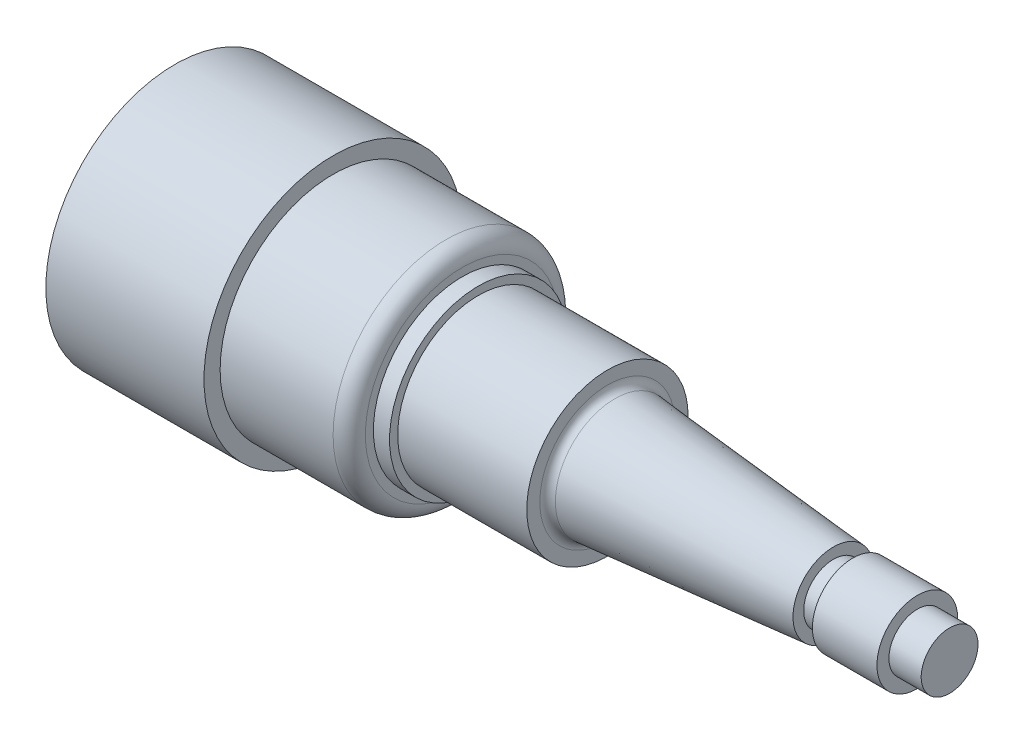
ISO-10303-21;
HEADER;
FILE_DESCRIPTION(('STEP AP214'),'2;1');
FILE_NAME('part.step','',(''),(''),'','','');
FILE_SCHEMA(('AUTOMOTIVE_DESIGN { 1 0 10303 214 1 1 1 1 }'));
ENDSEC;
DATA;
#1=APPLICATION_CONTEXT('core data for automotive mechanical design processes');
#2=APPLICATION_PROTOCOL_DEFINITION('international standard','automotive_design',2000,#1);
#3=PRODUCT_CONTEXT('',#1,'mechanical');
#4=PRODUCT('Part','Part','',(#3));
#5=PRODUCT_RELATED_PRODUCT_CATEGORY('part','',(#4));
#6=PRODUCT_DEFINITION_FORMATION('','',#4);
#7=PRODUCT_DEFINITION_CONTEXT('part definition',#1,'design');
#8=PRODUCT_DEFINITION('design','',#6,#7);
#9=PRODUCT_DEFINITION_SHAPE('','',#8);
#10=(LENGTH_UNIT() NAMED_UNIT(*) SI_UNIT(.MILLI.,.METRE.));
#11=(NAMED_UNIT(*) PLANE_ANGLE_UNIT() SI_UNIT($,.RADIAN.));
#12=(NAMED_UNIT(*) SI_UNIT($,.STERADIAN.) SOLID_ANGLE_UNIT());
#13=UNCERTAINTY_MEASURE_WITH_UNIT(LENGTH_MEASURE(1.E-05),#10,'distance_accuracy_value','');
#14=(GEOMETRIC_REPRESENTATION_CONTEXT(3) GLOBAL_UNCERTAINTY_ASSIGNED_CONTEXT((#13)) GLOBAL_UNIT_ASSIGNED_CONTEXT((#10,
#11,#12)) REPRESENTATION_CONTEXT('',''));
#15=CARTESIAN_POINT('',(0.,0.,0.));
#16=DIRECTION('',(0.,0.,1.));
#17=DIRECTION('',(1.,0.,0.));
#18=AXIS2_PLACEMENT_3D('',#15,#16,#17);
#19=CARTESIAN_POINT('',(-65.7098,0.,0.));
#20=DIRECTION('',(1.,0.,0.));
#21=DIRECTION('',(0.,0.,-1.));
#22=AXIS2_PLACEMENT_3D('',#19,#20,#21);
#23=TOROIDAL_SURFACE('',#22,13.303516766899,1.6002);
#24=CARTESIAN_POINT('',(-65.8491978962944,0.,0.));
#25=DIRECTION('',(1.,0.,0.));
#26=DIRECTION('',(0.,0.,-1.));
#27=AXIS2_PLACEMENT_3D('',#24,#25,#26);
#28=CIRCLE('',#27,11.7094);
#29=CARTESIAN_POINT('',(-65.8491978962944,0.,-11.7094));
#30=VERTEX_POINT('',#29);
#31=EDGE_CURVE('E89',#30,#30,#28,.T.);
#32=ORIENTED_EDGE('',*,*,#31,.F.);
#33=EDGE_LOOP('',(#32));
#34=FACE_BOUND('',#33,.T.);
#35=CARTESIAN_POINT('',(-67.31,0.,0.));
#36=DIRECTION('',(1.,0.,0.));
#37=DIRECTION('',(0.,0.,-1.));
#38=AXIS2_PLACEMENT_3D('',#35,#36,#37);
#39=CIRCLE('',#38,13.303516766899);
#40=CARTESIAN_POINT('',(-67.31,0.,-13.303516766899));
#41=VERTEX_POINT('',#40);
#42=EDGE_CURVE('E10',#41,#41,#39,.T.);
#43=ORIENTED_EDGE('',*,*,#42,.T.);
#44=EDGE_LOOP('',(#43));
#45=FACE_BOUND('',#44,.T.);
#46=ADVANCED_FACE('F31',(#34,#45),#23,.F.);
#47=CARTESIAN_POINT('',(-67.31,-13.303516766899,0.));
#48=DIRECTION('',(-1.,0.,0.));
#49=DIRECTION('',(0.,0.,1.));
#50=AXIS2_PLACEMENT_3D('',#47,#48,#49);
#51=PLANE('',#50);
#52=ORIENTED_EDGE('',*,*,#42,.F.);
#53=EDGE_LOOP('',(#52));
#54=FACE_BOUND('',#53,.T.);
#55=CARTESIAN_POINT('',(-67.31,0.,0.));
#56=DIRECTION('',(1.,0.,0.));
#57=DIRECTION('',(0.,0.,-1.));
#58=AXIS2_PLACEMENT_3D('',#55,#56,#57);
#59=CIRCLE('',#58,15.875);
#60=CARTESIAN_POINT('',(-67.31,0.,-15.875));
#61=VERTEX_POINT('',#60);
#62=EDGE_CURVE('E37',#61,#61,#59,.T.);
#63=ORIENTED_EDGE('',*,*,#62,.T.);
#64=EDGE_LOOP('',(#63));
#65=FACE_BOUND('',#64,.T.);
#66=ADVANCED_FACE('F96',(#54,#65),#51,.F.);
#67=CARTESIAN_POINT('',(88.99,0.,0.));
#68=DIRECTION('',(1.,0.,0.));
#69=DIRECTION('',(0.,0.,-1.));
#70=AXIS2_PLACEMENT_3D('',#67,#68,#69);
#71=CYLINDRICAL_SURFACE('',#70,15.875);
#72=ORIENTED_EDGE('',*,*,#62,.F.);
#73=EDGE_LOOP('',(#72));
#74=FACE_BOUND('',#73,.T.);
#75=CARTESIAN_POINT('',(-92.71,0.,0.));
#76=DIRECTION('',(1.,0.,0.));
#77=DIRECTION('',(0.,0.,-1.));
#78=AXIS2_PLACEMENT_3D('',#75,#76,#77);
#79=CIRCLE('',#78,15.875);
#80=CARTESIAN_POINT('',(-92.71,0.,-15.875));
#81=VERTEX_POINT('',#80);
#82=EDGE_CURVE('E41',#81,#81,#79,.T.);
#83=ORIENTED_EDGE('',*,*,#82,.T.);
#84=EDGE_LOOP('',(#83));
#85=FACE_BOUND('',#84,.T.);
#86=ADVANCED_FACE('F100',(#74,#85),#71,.T.);
#87=CARTESIAN_POINT('',(-92.71,-15.875,0.));
#88=DIRECTION('',(-1.,0.,0.));
#89=DIRECTION('',(0.,0.,1.));
#90=AXIS2_PLACEMENT_3D('',#87,#88,#89);
#91=PLANE('',#90);
#92=ORIENTED_EDGE('',*,*,#82,.F.);
#93=EDGE_LOOP('',(#92));
#94=FACE_BOUND('',#93,.T.);
#95=CARTESIAN_POINT('',(-92.71,0.,0.));
#96=DIRECTION('',(1.,0.,0.));
#97=DIRECTION('',(0.,0.,-1.));
#98=AXIS2_PLACEMENT_3D('',#95,#96,#97);
#99=CIRCLE('',#98,17.4752);
#100=CARTESIAN_POINT('',(-92.71,0.,-17.4752));
#101=VERTEX_POINT('',#100);
#102=EDGE_CURVE('E45',#101,#101,#99,.T.);
#103=ORIENTED_EDGE('',*,*,#102,.T.);
#104=EDGE_LOOP('',(#103));
#105=FACE_BOUND('',#104,.T.);
#106=ADVANCED_FACE('F105',(#94,#105),#91,.F.);
#107=CARTESIAN_POINT('',(88.99,0.,0.));
#108=DIRECTION('',(1.,0.,0.));
#109=DIRECTION('',(0.,0.,-1.));
#110=AXIS2_PLACEMENT_3D('',#107,#108,#109);
#111=CYLINDRICAL_SURFACE('',#110,17.4752);
#112=ORIENTED_EDGE('',*,*,#102,.F.);
#113=EDGE_LOOP('',(#112));
#114=FACE_BOUND('',#113,.T.);
#115=CARTESIAN_POINT('',(-95.885,0.,0.));
#116=DIRECTION('',(1.,0.,0.));
#117=DIRECTION('',(0.,0.,-1.));
#118=AXIS2_PLACEMENT_3D('',#115,#116,#117);
#119=CIRCLE('',#118,17.4752);
#120=CARTESIAN_POINT('',(-95.885,0.,-17.4752));
#121=VERTEX_POINT('',#120);
#122=EDGE_CURVE('E50',#121,#121,#119,.T.);
#123=ORIENTED_EDGE('',*,*,#122,.T.);
#124=EDGE_LOOP('',(#123));
#125=FACE_BOUND('',#124,.T.);
#126=ADVANCED_FACE('F111',(#114,#125),#111,.T.);
#127=CARTESIAN_POINT('',(-95.885,-17.4752,0.));
#128=DIRECTION('',(-1.,0.,0.));
#129=DIRECTION('',(0.,0.,1.));
#130=AXIS2_PLACEMENT_3D('',#127,#128,#129);
#131=PLANE('',#130);
#132=ORIENTED_EDGE('',*,*,#122,.F.);
#133=EDGE_LOOP('',(#132));
#134=FACE_BOUND('',#133,.T.);
#135=CARTESIAN_POINT('',(-95.885,0.,0.));
#136=DIRECTION('',(1.,0.,0.));
#137=DIRECTION('',(0.,0.,-1.));
#138=AXIS2_PLACEMENT_3D('',#135,#136,#137);
#139=CIRCLE('',#138,19.05);
#140=CARTESIAN_POINT('',(-95.885,0.,-19.05));
#141=VERTEX_POINT('',#140);
#142=EDGE_CURVE('E53',#141,#141,#139,.T.);
#143=ORIENTED_EDGE('',*,*,#142,.T.);
#144=EDGE_LOOP('',(#143));
#145=FACE_BOUND('',#144,.T.);
#146=ADVANCED_FACE('F115',(#134,#145),#131,.F.);
#147=CARTESIAN_POINT('',(-99.06,0.,0.));
#148=DIRECTION('',(1.,0.,0.));
#149=DIRECTION('',(0.,0.,-1.));
#150=AXIS2_PLACEMENT_3D('',#147,#148,#149);
#151=TOROIDAL_SURFACE('',#150,19.05,3.175);
#152=ORIENTED_EDGE('',*,*,#142,.F.);
#153=EDGE_LOOP('',(#152));
#154=FACE_BOUND('',#153,.T.);
#155=CARTESIAN_POINT('',(-99.06,0.,0.));
#156=DIRECTION('',(1.,0.,0.));
#157=DIRECTION('',(0.,0.,-1.));
#158=AXIS2_PLACEMENT_3D('',#155,#156,#157);
#159=CIRCLE('',#158,22.225);
#160=CARTESIAN_POINT('',(-99.06,0.,-22.225));
#161=VERTEX_POINT('',#160);
#162=EDGE_CURVE('E56',#161,#161,#159,.T.);
#163=ORIENTED_EDGE('',*,*,#162,.T.);
#164=EDGE_LOOP('',(#163));
#165=FACE_BOUND('',#164,.T.);
#166=ADVANCED_FACE('F119',(#154,#165),#151,.T.);
#167=CARTESIAN_POINT('',(88.99,0.,0.));
#168=DIRECTION('',(1.,0.,0.));
#169=DIRECTION('',(0.,0.,-1.));
#170=AXIS2_PLACEMENT_3D('',#167,#168,#169);
#171=CYLINDRICAL_SURFACE('',#170,22.225);
#172=ORIENTED_EDGE('',*,*,#162,.F.);
#173=EDGE_LOOP('',(#172));
#174=FACE_BOUND('',#173,.T.);
#175=CARTESIAN_POINT('',(-121.285,0.,0.));
#176=DIRECTION('',(1.,0.,0.));
#177=DIRECTION('',(0.,0.,-1.));
#178=AXIS2_PLACEMENT_3D('',#175,#176,#177);
#179=CIRCLE('',#178,22.225);
#180=CARTESIAN_POINT('',(-121.285,0.,-22.225));
#181=VERTEX_POINT('',#180);
#182=EDGE_CURVE('E59',#181,#181,#179,.T.);
#183=ORIENTED_EDGE('',*,*,#182,.T.);
#184=EDGE_LOOP('',(#183));
#185=FACE_BOUND('',#184,.T.);
#186=ADVANCED_FACE('F123',(#174,#185),#171,.T.);
#187=CARTESIAN_POINT('',(-121.285,-22.225,0.));
#188=DIRECTION('',(-1.,0.,0.));
#189=DIRECTION('',(0.,0.,1.));
#190=AXIS2_PLACEMENT_3D('',#187,#188,#189);
#191=PLANE('',#190);
#192=ORIENTED_EDGE('',*,*,#182,.F.);
#193=EDGE_LOOP('',(#192));
#194=FACE_BOUND('',#193,.T.);
#195=CARTESIAN_POINT('',(-121.285,0.,0.));
#196=DIRECTION('',(1.,0.,0.));
#197=DIRECTION('',(0.,0.,-1.));
#198=AXIS2_PLACEMENT_3D('',#195,#196,#197);
#199=CIRCLE('',#198,25.4);
#200=CARTESIAN_POINT('',(-121.285,0.,-25.4));
#201=VERTEX_POINT('',#200);
#202=EDGE_CURVE('E62',#201,#201,#199,.T.);
#203=ORIENTED_EDGE('',*,*,#202,.T.);
#204=EDGE_LOOP('',(#203));
#205=FACE_BOUND('',#204,.T.);
#206=ADVANCED_FACE('F127',(#194,#205),#191,.F.);
#207=CARTESIAN_POINT('',(88.99,0.,0.));
#208=DIRECTION('',(1.,0.,0.));
#209=DIRECTION('',(0.,0.,-1.));
#210=AXIS2_PLACEMENT_3D('',#207,#208,#209);
#211=CYLINDRICAL_SURFACE('',#210,25.4);
#212=ORIENTED_EDGE('',*,*,#202,.F.);
#213=EDGE_LOOP('',(#212));
#214=FACE_BOUND('',#213,.T.);
#215=CARTESIAN_POINT('',(-152.4,0.,0.));
#216=DIRECTION('',(1.,0.,0.));
#217=DIRECTION('',(0.,0.,-1.));
#218=AXIS2_PLACEMENT_3D('',#215,#216,#217);
#219=CIRCLE('',#218,25.4);
#220=CARTESIAN_POINT('',(-152.4,0.,-25.4));
#221=VERTEX_POINT('',#220);
#222=EDGE_CURVE('E65',#221,#221,#219,.T.);
#223=ORIENTED_EDGE('',*,*,#222,.T.);
#224=EDGE_LOOP('',(#223));
#225=FACE_BOUND('',#224,.T.);
#226=ADVANCED_FACE('F131',(#214,#225),#211,.T.);
#227=CARTESIAN_POINT('',(-152.4,-25.4,0.));
#228=DIRECTION('',(1.,0.,0.));
#229=DIRECTION('',(0.,0.,-1.));
#230=AXIS2_PLACEMENT_3D('',#227,#228,#229);
#231=PLANE('',#230);
#232=ORIENTED_EDGE('',*,*,#222,.F.);
#233=EDGE_LOOP('',(#232));
#234=FACE_BOUND('',#233,.T.);
#235=ADVANCED_FACE('F135',(#234),#231,.F.);
#236=CARTESIAN_POINT('',(0.,0.,0.));
#237=DIRECTION('',(-1.,0.,0.));
#238=DIRECTION('',(0.,0.,1.));
#239=AXIS2_PLACEMENT_3D('',#236,#237,#238);
#240=PLANE('',#239);
#241=CARTESIAN_POINT('',(0.,0.,0.));
#242=DIRECTION('',(1.,0.,0.));
#243=DIRECTION('',(0.,0.,-1.));
#244=AXIS2_PLACEMENT_3D('',#241,#242,#243);
#245=CIRCLE('',#244,5.588);
#246=CARTESIAN_POINT('',(0.,0.,-5.588));
#247=VERTEX_POINT('',#246);
#248=EDGE_CURVE('E68',#247,#247,#245,.T.);
#249=ORIENTED_EDGE('',*,*,#248,.T.);
#250=EDGE_LOOP('',(#249));
#251=FACE_BOUND('',#250,.T.);
#252=ADVANCED_FACE('F139',(#251),#240,.F.);
#253=CARTESIAN_POINT('',(88.99,0.,0.));
#254=DIRECTION('',(1.,0.,0.));
#255=DIRECTION('',(0.,0.,-1.));
#256=AXIS2_PLACEMENT_3D('',#253,#254,#255);
#257=CYLINDRICAL_SURFACE('',#256,5.588);
#258=ORIENTED_EDGE('',*,*,#248,.F.);
#259=EDGE_LOOP('',(#258));
#260=FACE_BOUND('',#259,.T.);
#261=CARTESIAN_POINT('',(-6.34999999999999,0.,0.));
#262=DIRECTION('',(1.,0.,0.));
#263=DIRECTION('',(0.,0.,-1.));
#264=AXIS2_PLACEMENT_3D('',#261,#262,#263);
#265=CIRCLE('',#264,5.588);
#266=CARTESIAN_POINT('',(-6.34999999999999,0.,-5.588));
#267=VERTEX_POINT('',#266);
#268=EDGE_CURVE('E71',#267,#267,#265,.T.);
#269=ORIENTED_EDGE('',*,*,#268,.T.);
#270=EDGE_LOOP('',(#269));
#271=FACE_BOUND('',#270,.T.);
#272=ADVANCED_FACE('F143',(#260,#271),#257,.T.);
#273=CARTESIAN_POINT('',(-6.35,-5.588,0.));
#274=DIRECTION('',(-1.,0.,0.));
#275=DIRECTION('',(0.,0.,1.));
#276=AXIS2_PLACEMENT_3D('',#273,#274,#275);
#277=PLANE('',#276);
#278=ORIENTED_EDGE('',*,*,#268,.F.);
#279=EDGE_LOOP('',(#278));
#280=FACE_BOUND('',#279,.T.);
#281=CARTESIAN_POINT('',(-6.34999999999999,0.,0.));
#282=DIRECTION('',(1.,0.,0.));
#283=DIRECTION('',(0.,0.,-1.));
#284=AXIS2_PLACEMENT_3D('',#281,#282,#283);
#285=CIRCLE('',#284,7.9502);
#286=CARTESIAN_POINT('',(-6.34999999999999,0.,-7.9502));
#287=VERTEX_POINT('',#286);
#288=EDGE_CURVE('E74',#287,#287,#285,.T.);
#289=ORIENTED_EDGE('',*,*,#288,.T.);
#290=EDGE_LOOP('',(#289));
#291=FACE_BOUND('',#290,.T.);
#292=ADVANCED_FACE('F147',(#280,#291),#277,.F.);
#293=CARTESIAN_POINT('',(88.99,0.,0.));
#294=DIRECTION('',(1.,0.,0.));
#295=DIRECTION('',(0.,0.,-1.));
#296=AXIS2_PLACEMENT_3D('',#293,#294,#295);
#297=CYLINDRICAL_SURFACE('',#296,7.9502);
#298=ORIENTED_EDGE('',*,*,#288,.F.);
#299=EDGE_LOOP('',(#298));
#300=FACE_BOUND('',#299,.T.);
#301=CARTESIAN_POINT('',(-19.05,0.,0.));
#302=DIRECTION('',(1.,0.,0.));
#303=DIRECTION('',(0.,0.,-1.));
#304=AXIS2_PLACEMENT_3D('',#301,#302,#303);
#305=CIRCLE('',#304,7.9502);
#306=CARTESIAN_POINT('',(-19.05,0.,-7.9502));
#307=VERTEX_POINT('',#306);
#308=EDGE_CURVE('E77',#307,#307,#305,.T.);
#309=ORIENTED_EDGE('',*,*,#308,.T.);
#310=EDGE_LOOP('',(#309));
#311=FACE_BOUND('',#310,.T.);
#312=ADVANCED_FACE('F151',(#300,#311),#297,.T.);
#313=CARTESIAN_POINT('',(-19.05,-5.842,0.));
#314=DIRECTION('',(1.,0.,0.));
#315=DIRECTION('',(0.,0.,-1.));
#316=AXIS2_PLACEMENT_3D('',#313,#314,#315);
#317=PLANE('',#316);
#318=ORIENTED_EDGE('',*,*,#308,.F.);
#319=EDGE_LOOP('',(#318));
#320=FACE_BOUND('',#319,.T.);
#321=CARTESIAN_POINT('',(-19.05,0.,0.));
#322=DIRECTION('',(1.,0.,0.));
#323=DIRECTION('',(0.,0.,-1.));
#324=AXIS2_PLACEMENT_3D('',#321,#322,#323);
#325=CIRCLE('',#324,5.842);
#326=CARTESIAN_POINT('',(-19.05,0.,-5.842));
#327=VERTEX_POINT('',#326);
#328=EDGE_CURVE('E80',#327,#327,#325,.T.);
#329=ORIENTED_EDGE('',*,*,#328,.T.);
#330=EDGE_LOOP('',(#329));
#331=FACE_BOUND('',#330,.T.);
#332=ADVANCED_FACE('F155',(#320,#331),#317,.F.);
#333=CARTESIAN_POINT('',(88.99,0.,0.));
#334=DIRECTION('',(1.,0.,0.));
#335=DIRECTION('',(0.,0.,-1.));
#336=AXIS2_PLACEMENT_3D('',#333,#334,#335);
#337=CYLINDRICAL_SURFACE('',#336,5.842);
#338=ORIENTED_EDGE('',*,*,#328,.F.);
#339=EDGE_LOOP('',(#338));
#340=FACE_BOUND('',#339,.T.);
#341=CARTESIAN_POINT('',(-22.86,0.,0.));
#342=DIRECTION('',(1.,0.,0.));
#343=DIRECTION('',(0.,0.,-1.));
#344=AXIS2_PLACEMENT_3D('',#341,#342,#343);
#345=CIRCLE('',#344,5.842);
#346=CARTESIAN_POINT('',(-22.86,0.,-5.842));
#347=VERTEX_POINT('',#346);
#348=EDGE_CURVE('E83',#347,#347,#345,.T.);
#349=ORIENTED_EDGE('',*,*,#348,.T.);
#350=EDGE_LOOP('',(#349));
#351=FACE_BOUND('',#350,.T.);
#352=ADVANCED_FACE('F159',(#340,#351),#337,.T.);
#353=CARTESIAN_POINT('',(-22.86,-5.842,0.));
#354=DIRECTION('',(-1.,0.,0.));
#355=DIRECTION('',(0.,0.,1.));
#356=AXIS2_PLACEMENT_3D('',#353,#354,#355);
#357=PLANE('',#356);
#358=ORIENTED_EDGE('',*,*,#348,.F.);
#359=EDGE_LOOP('',(#358));
#360=FACE_BOUND('',#359,.T.);
#361=CARTESIAN_POINT('',(-22.8600000000001,0.,0.));
#362=DIRECTION('',(1.,0.,0.));
#363=DIRECTION('',(0.,0.,-1.));
#364=AXIS2_PLACEMENT_3D('',#361,#362,#363);
#365=CIRCLE('',#364,7.95019999999997);
#366=CARTESIAN_POINT('',(-22.8600000000001,0.,-7.95019999999997));
#367=VERTEX_POINT('',#366);
#368=EDGE_CURVE('E86',#367,#367,#365,.T.);
#369=ORIENTED_EDGE('',*,*,#368,.T.);
#370=EDGE_LOOP('',(#369));
#371=FACE_BOUND('',#370,.T.);
#372=ADVANCED_FACE('F163',(#360,#371),#357,.F.);
#373=CARTESIAN_POINT('',(-65.8491978962944,0.,0.));
#374=DIRECTION('',(-1.,0.,0.));
#375=DIRECTION('',(0.,0.,1.));
#376=AXIS2_PLACEMENT_3D('',#373,#374,#375);
#377=CONICAL_SURFACE('',#376,11.7094,0.0872233519685565);
#378=ORIENTED_EDGE('',*,*,#368,.F.);
#379=EDGE_LOOP('',(#378));
#380=FACE_BOUND('',#379,.T.);
#381=ORIENTED_EDGE('',*,*,#31,.T.);
#382=EDGE_LOOP('',(#381));
#383=FACE_BOUND('',#382,.T.);
#384=ADVANCED_FACE('F93',(#380,#383),#377,.T.);
#385=CLOSED_SHELL('',(#46,#66,#86,#106,#126,#146,#166,#186,#206,#226,#235,#252,#272,#292,#312,
#332,#352,#372,#384));
#386=MANIFOLD_SOLID_BREP('B2',#385);
#387=ADVANCED_BREP_SHAPE_REPRESENTATION('',(#18,#386),#14);
#388=SHAPE_DEFINITION_REPRESENTATION(#9,#387);
ENDSEC;
END-ISO-10303-21;
